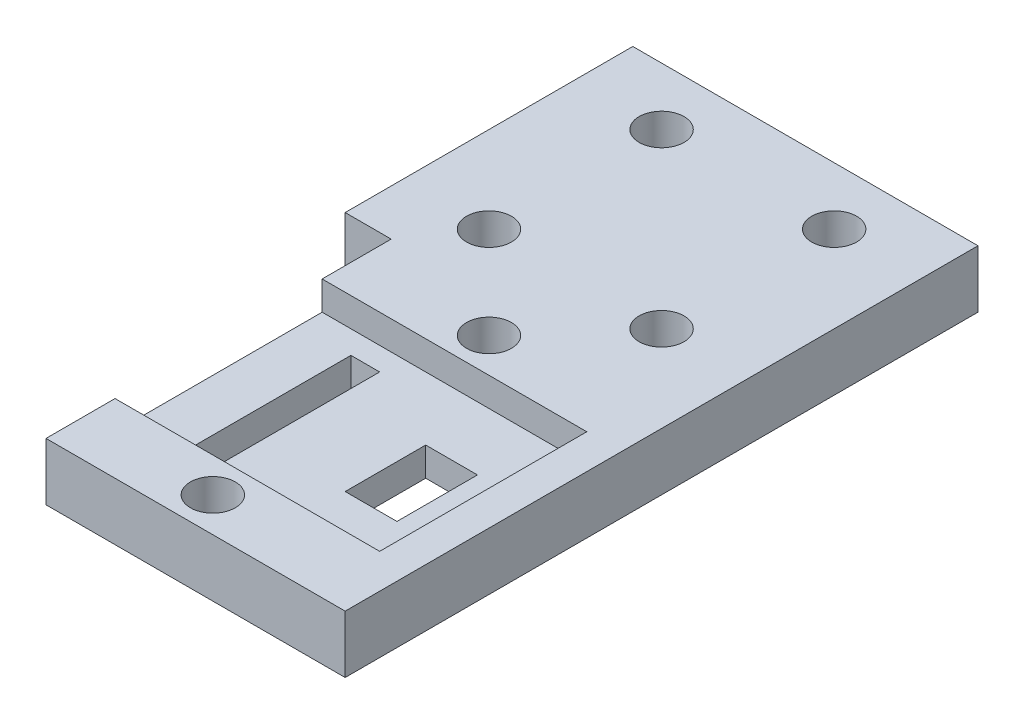
ISO-10303-21;
HEADER;
FILE_DESCRIPTION(('STEP AP214'),'2;1');
FILE_NAME('part.step','',(''),(''),'','','');
FILE_SCHEMA(('AUTOMOTIVE_DESIGN { 1 0 10303 214 1 1 1 1 }'));
ENDSEC;
DATA;
#1=APPLICATION_CONTEXT('core data for automotive mechanical design processes');
#2=APPLICATION_PROTOCOL_DEFINITION('international standard','automotive_design',2000,#1);
#3=PRODUCT_CONTEXT('',#1,'mechanical');
#4=PRODUCT('Part','Part','',(#3));
#5=PRODUCT_RELATED_PRODUCT_CATEGORY('part','',(#4));
#6=PRODUCT_DEFINITION_FORMATION('','',#4);
#7=PRODUCT_DEFINITION_CONTEXT('part definition',#1,'design');
#8=PRODUCT_DEFINITION('design','',#6,#7);
#9=PRODUCT_DEFINITION_SHAPE('','',#8);
#10=(LENGTH_UNIT() NAMED_UNIT(*) SI_UNIT(.MILLI.,.METRE.));
#11=(NAMED_UNIT(*) PLANE_ANGLE_UNIT() SI_UNIT($,.RADIAN.));
#12=(NAMED_UNIT(*) SI_UNIT($,.STERADIAN.) SOLID_ANGLE_UNIT());
#13=UNCERTAINTY_MEASURE_WITH_UNIT(LENGTH_MEASURE(1.E-05),#10,'distance_accuracy_value','');
#14=(GEOMETRIC_REPRESENTATION_CONTEXT(3) GLOBAL_UNCERTAINTY_ASSIGNED_CONTEXT((#13)) GLOBAL_UNIT_ASSIGNED_CONTEXT((#10,
#11,#12)) REPRESENTATION_CONTEXT('',''));
#15=CARTESIAN_POINT('',(0.,0.,0.));
#16=DIRECTION('',(0.,0.,1.));
#17=DIRECTION('',(1.,0.,0.));
#18=AXIS2_PLACEMENT_3D('',#15,#16,#17);
#19=CARTESIAN_POINT('',(0.,5.,0.));
#20=DIRECTION('',(0.,-1.,0.));
#21=DIRECTION('',(0.,0.,-1.));
#22=AXIS2_PLACEMENT_3D('',#19,#20,#21);
#23=PLANE('',#22);
#24=DIRECTION('',(0.,0.,-1.));
#25=VECTOR('',#24,1.);
#26=CARTESIAN_POINT('',(27.,5.,-11.));
#27=LINE('',#26,#25);
#28=CARTESIAN_POINT('',(27.,5.,-11.));
#29=VERTEX_POINT('',#28);
#30=CARTESIAN_POINT('',(27.,5.,-29.));
#31=VERTEX_POINT('',#30);
#32=EDGE_CURVE('E221',#29,#31,#27,.T.);
#33=ORIENTED_EDGE('',*,*,#32,.F.);
#34=DIRECTION('',(1.,0.,0.));
#35=VECTOR('',#34,1.);
#36=CARTESIAN_POINT('',(27.,5.,-11.));
#37=LINE('',#36,#35);
#38=CARTESIAN_POINT('',(4.,5.,-11.));
#39=VERTEX_POINT('',#38);
#40=EDGE_CURVE('E232',#39,#29,#37,.T.);
#41=ORIENTED_EDGE('',*,*,#40,.F.);
#42=DIRECTION('',(0.,0.,1.));
#43=VECTOR('',#42,1.);
#44=CARTESIAN_POINT('',(4.,5.,0.));
#45=LINE('',#44,#43);
#46=CARTESIAN_POINT('',(4.,5.,-5.));
#47=VERTEX_POINT('',#46);
#48=EDGE_CURVE('E266',#39,#47,#45,.T.);
#49=ORIENTED_EDGE('',*,*,#48,.T.);
#50=DIRECTION('',(-1.,0.,0.));
#51=VECTOR('',#50,1.);
#52=CARTESIAN_POINT('',(0.,5.,-5.));
#53=LINE('',#52,#51);
#54=CARTESIAN_POINT('',(30.,5.,-5.));
#55=VERTEX_POINT('',#54);
#56=EDGE_CURVE('E270',#55,#47,#53,.T.);
#57=ORIENTED_EDGE('',*,*,#56,.F.);
#58=DIRECTION('',(0.,0.,-1.));
#59=VECTOR('',#58,1.);
#60=CARTESIAN_POINT('',(30.,5.,0.));
#61=LINE('',#60,#59);
#62=CARTESIAN_POINT('',(30.,5.,-60.));
#63=VERTEX_POINT('',#62);
#64=EDGE_CURVE('E321',#55,#63,#61,.T.);
#65=ORIENTED_EDGE('',*,*,#64,.T.);
#66=DIRECTION('',(-1.,0.,0.));
#67=VECTOR('',#66,1.);
#68=CARTESIAN_POINT('',(0.,5.,-60.));
#69=LINE('',#68,#67);
#70=CARTESIAN_POINT('',(0.,5.,-60.));
#71=VERTEX_POINT('',#70);
#72=EDGE_CURVE('E324',#63,#71,#69,.T.);
#73=ORIENTED_EDGE('',*,*,#72,.T.);
#74=DIRECTION('',(0.,0.,1.));
#75=VECTOR('',#74,1.);
#76=CARTESIAN_POINT('',(0.,5.,0.));
#77=LINE('',#76,#75);
#78=CARTESIAN_POINT('',(0.,5.,-35.));
#79=VERTEX_POINT('',#78);
#80=EDGE_CURVE('E318',#71,#79,#77,.T.);
#81=ORIENTED_EDGE('',*,*,#80,.T.);
#82=DIRECTION('',(-1.,0.,0.));
#83=VECTOR('',#82,1.);
#84=CARTESIAN_POINT('',(0.,5.,-35.));
#85=LINE('',#84,#83);
#86=CARTESIAN_POINT('',(4.,5.,-35.));
#87=VERTEX_POINT('',#86);
#88=EDGE_CURVE('E280',#87,#79,#85,.T.);
#89=ORIENTED_EDGE('',*,*,#88,.F.);
#90=CARTESIAN_POINT('',(4.,5.,-29.));
#91=VERTEX_POINT('',#90);
#92=EDGE_CURVE('E277',#87,#91,#45,.T.);
#93=ORIENTED_EDGE('',*,*,#92,.T.);
#94=DIRECTION('',(-1.,0.,0.));
#95=VECTOR('',#94,1.);
#96=CARTESIAN_POINT('',(27.,5.,-29.));
#97=LINE('',#96,#95);
#98=EDGE_CURVE('E242',#31,#91,#97,.T.);
#99=ORIENTED_EDGE('',*,*,#98,.F.);
#100=EDGE_LOOP('',(#33,#41,#49,#57,#65,#73,#81,#89,#93,#99));
#101=FACE_BOUND('',#100,.T.);
#102=CARTESIAN_POINT('',(7.5,5.,-55.));
#103=DIRECTION('',(0.,1.,0.));
#104=DIRECTION('',(0.,0.,1.));
#105=AXIS2_PLACEMENT_3D('',#102,#103,#104);
#106=CIRCLE('',#105,1.94999999999999);
#107=CARTESIAN_POINT('',(7.5,5.,-53.05));
#108=VERTEX_POINT('',#107);
#109=EDGE_CURVE('E311',#108,#108,#106,.T.);
#110=ORIENTED_EDGE('',*,*,#109,.F.);
#111=EDGE_LOOP('',(#110));
#112=FACE_BOUND('',#111,.T.);
#113=CARTESIAN_POINT('',(22.5,5.,-55.));
#114=DIRECTION('',(0.,1.,0.));
#115=DIRECTION('',(0.,0.,1.));
#116=AXIS2_PLACEMENT_3D('',#113,#114,#115);
#117=CIRCLE('',#116,1.94999999999999);
#118=CARTESIAN_POINT('',(22.5,5.,-53.05));
#119=VERTEX_POINT('',#118);
#120=EDGE_CURVE('E305',#119,#119,#117,.T.);
#121=ORIENTED_EDGE('',*,*,#120,.F.);
#122=EDGE_LOOP('',(#121));
#123=FACE_BOUND('',#122,.T.);
#124=CARTESIAN_POINT('',(22.5,5.,-40.));
#125=DIRECTION('',(0.,1.,0.));
#126=DIRECTION('',(0.,0.,1.));
#127=AXIS2_PLACEMENT_3D('',#124,#125,#126);
#128=CIRCLE('',#127,1.94999999999999);
#129=CARTESIAN_POINT('',(22.5,5.,-38.05));
#130=VERTEX_POINT('',#129);
#131=EDGE_CURVE('E299',#130,#130,#128,.T.);
#132=ORIENTED_EDGE('',*,*,#131,.F.);
#133=EDGE_LOOP('',(#132));
#134=FACE_BOUND('',#133,.T.);
#135=CARTESIAN_POINT('',(7.5,5.,-40.));
#136=DIRECTION('',(0.,1.,0.));
#137=DIRECTION('',(0.,0.,1.));
#138=AXIS2_PLACEMENT_3D('',#135,#136,#137);
#139=CIRCLE('',#138,1.94999999999999);
#140=CARTESIAN_POINT('',(7.5,5.,-38.05));
#141=VERTEX_POINT('',#140);
#142=EDGE_CURVE('E287',#141,#141,#139,.T.);
#143=ORIENTED_EDGE('',*,*,#142,.F.);
#144=EDGE_LOOP('',(#143));
#145=FACE_BOUND('',#144,.T.);
#146=CARTESIAN_POINT('',(15.5,5.,-8.));
#147=DIRECTION('',(0.,1.,0.));
#148=DIRECTION('',(0.,0.,1.));
#149=AXIS2_PLACEMENT_3D('',#146,#147,#148);
#150=CIRCLE('',#149,1.94999999999999);
#151=CARTESIAN_POINT('',(15.5,5.,-6.05000000000001));
#152=VERTEX_POINT('',#151);
#153=EDGE_CURVE('E260',#152,#152,#150,.T.);
#154=ORIENTED_EDGE('',*,*,#153,.F.);
#155=EDGE_LOOP('',(#154));
#156=FACE_BOUND('',#155,.T.);
#157=CARTESIAN_POINT('',(15.5,5.,-32.));
#158=DIRECTION('',(0.,1.,0.));
#159=DIRECTION('',(0.,0.,1.));
#160=AXIS2_PLACEMENT_3D('',#157,#158,#159);
#161=CIRCLE('',#160,1.94999999999999);
#162=CARTESIAN_POINT('',(15.5,5.,-30.05));
#163=VERTEX_POINT('',#162);
#164=EDGE_CURVE('E248',#163,#163,#161,.T.);
#165=ORIENTED_EDGE('',*,*,#164,.F.);
#166=EDGE_LOOP('',(#165));
#167=FACE_BOUND('',#166,.T.);
#168=ADVANCED_FACE('F34',(#101,#112,#123,#134,#145,#156,#167),#23,.F.);
#169=CARTESIAN_POINT('',(0.,5.,0.));
#170=DIRECTION('',(1.,0.,0.));
#171=DIRECTION('',(0.,0.,-1.));
#172=AXIS2_PLACEMENT_3D('',#169,#170,#171);
#173=PLANE('',#172);
#174=DIRECTION('',(0.,0.,1.));
#175=VECTOR('',#174,1.);
#176=CARTESIAN_POINT('',(0.,0.,0.));
#177=LINE('',#176,#175);
#178=CARTESIAN_POINT('',(0.,0.,-60.));
#179=VERTEX_POINT('',#178);
#180=CARTESIAN_POINT('',(0.,0.,-35.));
#181=VERTEX_POINT('',#180);
#182=EDGE_CURVE('E317',#179,#181,#177,.T.);
#183=ORIENTED_EDGE('',*,*,#182,.T.);
#184=DIRECTION('',(0.,1.,0.));
#185=VECTOR('',#184,1.);
#186=CARTESIAN_POINT('',(0.,0.,-35.));
#187=LINE('',#186,#185);
#188=EDGE_CURVE('E290',#181,#79,#187,.T.);
#189=ORIENTED_EDGE('',*,*,#188,.T.);
#190=ORIENTED_EDGE('',*,*,#80,.F.);
#191=DIRECTION('',(0.,-1.,0.));
#192=VECTOR('',#191,1.);
#193=CARTESIAN_POINT('',(0.,5.,-60.));
#194=LINE('',#193,#192);
#195=EDGE_CURVE('E42',#71,#179,#194,.T.);
#196=ORIENTED_EDGE('',*,*,#195,.T.);
#197=EDGE_LOOP('',(#183,#189,#190,#196));
#198=FACE_BOUND('',#197,.T.);
#199=ADVANCED_FACE('F36',(#198),#173,.F.);
#200=CARTESIAN_POINT('',(30.,5.,0.));
#201=DIRECTION('',(-1.,0.,0.));
#202=DIRECTION('',(0.,0.,1.));
#203=AXIS2_PLACEMENT_3D('',#200,#201,#202);
#204=PLANE('',#203);
#205=ORIENTED_EDGE('',*,*,#64,.F.);
#206=DIRECTION('',(0.,1.,0.));
#207=VECTOR('',#206,1.);
#208=CARTESIAN_POINT('',(30.,0.,-5.));
#209=LINE('',#208,#207);
#210=CARTESIAN_POINT('',(30.,0.,-5.));
#211=VERTEX_POINT('',#210);
#212=EDGE_CURVE('E288',#211,#55,#209,.T.);
#213=ORIENTED_EDGE('',*,*,#212,.F.);
#214=DIRECTION('',(0.,0.,-1.));
#215=VECTOR('',#214,1.);
#216=CARTESIAN_POINT('',(30.,0.,0.));
#217=LINE('',#216,#215);
#218=CARTESIAN_POINT('',(30.,0.,-60.));
#219=VERTEX_POINT('',#218);
#220=EDGE_CURVE('E328',#211,#219,#217,.T.);
#221=ORIENTED_EDGE('',*,*,#220,.T.);
#222=DIRECTION('',(0.,-1.,0.));
#223=VECTOR('',#222,1.);
#224=CARTESIAN_POINT('',(30.,5.,-60.));
#225=LINE('',#224,#223);
#226=EDGE_CURVE('E11',#63,#219,#225,.T.);
#227=ORIENTED_EDGE('',*,*,#226,.F.);
#228=EDGE_LOOP('',(#205,#213,#221,#227));
#229=FACE_BOUND('',#228,.T.);
#230=ADVANCED_FACE('F355',(#229),#204,.F.);
#231=CARTESIAN_POINT('',(0.,5.,-60.));
#232=DIRECTION('',(0.,0.,1.));
#233=DIRECTION('',(1.,0.,0.));
#234=AXIS2_PLACEMENT_3D('',#231,#232,#233);
#235=PLANE('',#234);
#236=DIRECTION('',(-1.,0.,0.));
#237=VECTOR('',#236,1.);
#238=CARTESIAN_POINT('',(0.,0.,-60.));
#239=LINE('',#238,#237);
#240=EDGE_CURVE('E322',#219,#179,#239,.T.);
#241=ORIENTED_EDGE('',*,*,#240,.T.);
#242=ORIENTED_EDGE('',*,*,#195,.F.);
#243=ORIENTED_EDGE('',*,*,#72,.F.);
#244=ORIENTED_EDGE('',*,*,#226,.T.);
#245=EDGE_LOOP('',(#241,#242,#243,#244));
#246=FACE_BOUND('',#245,.T.);
#247=ADVANCED_FACE('F353',(#246),#235,.F.);
#248=CARTESIAN_POINT('',(0.,0.,0.));
#249=DIRECTION('',(0.,-1.,0.));
#250=DIRECTION('',(0.,0.,-1.));
#251=AXIS2_PLACEMENT_3D('',#248,#249,#250);
#252=PLANE('',#251);
#253=DIRECTION('',(0.,0.,1.));
#254=VECTOR('',#253,1.);
#255=CARTESIAN_POINT('',(18.5,0.,-23.5));
#256=LINE('',#255,#254);
#257=CARTESIAN_POINT('',(18.5,0.,-23.5));
#258=VERTEX_POINT('',#257);
#259=CARTESIAN_POINT('',(18.5,0.,-16.5));
#260=VERTEX_POINT('',#259);
#261=EDGE_CURVE('E161',#258,#260,#256,.T.);
#262=ORIENTED_EDGE('',*,*,#261,.T.);
#263=DIRECTION('',(1.,0.,0.));
#264=VECTOR('',#263,1.);
#265=CARTESIAN_POINT('',(18.5,0.,-16.5));
#266=LINE('',#265,#264);
#267=CARTESIAN_POINT('',(23.,0.,-16.5));
#268=VERTEX_POINT('',#267);
#269=EDGE_CURVE('E170',#260,#268,#266,.T.);
#270=ORIENTED_EDGE('',*,*,#269,.T.);
#271=DIRECTION('',(0.,0.,-1.));
#272=VECTOR('',#271,1.);
#273=CARTESIAN_POINT('',(23.,0.,-23.5));
#274=LINE('',#273,#272);
#275=CARTESIAN_POINT('',(23.,0.,-23.5));
#276=VERTEX_POINT('',#275);
#277=EDGE_CURVE('E49',#268,#276,#274,.T.);
#278=ORIENTED_EDGE('',*,*,#277,.T.);
#279=DIRECTION('',(-1.,0.,0.));
#280=VECTOR('',#279,1.);
#281=CARTESIAN_POINT('',(18.5,0.,-23.5));
#282=LINE('',#281,#280);
#283=EDGE_CURVE('E167',#276,#258,#282,.T.);
#284=ORIENTED_EDGE('',*,*,#283,.T.);
#285=EDGE_LOOP('',(#262,#270,#278,#284));
#286=FACE_BOUND('',#285,.T.);
#287=DIRECTION('',(0.,0.,1.));
#288=VECTOR('',#287,1.);
#289=CARTESIAN_POINT('',(8.5,0.,-27.));
#290=LINE('',#289,#288);
#291=CARTESIAN_POINT('',(8.5,0.,-27.));
#292=VERTEX_POINT('',#291);
#293=CARTESIAN_POINT('',(8.5,0.,-13.));
#294=VERTEX_POINT('',#293);
#295=EDGE_CURVE('E196',#292,#294,#290,.T.);
#296=ORIENTED_EDGE('',*,*,#295,.T.);
#297=DIRECTION('',(1.,0.,0.));
#298=VECTOR('',#297,1.);
#299=CARTESIAN_POINT('',(8.5,0.,-13.));
#300=LINE('',#299,#298);
#301=CARTESIAN_POINT('',(11.,0.,-13.));
#302=VERTEX_POINT('',#301);
#303=EDGE_CURVE('E199',#294,#302,#300,.T.);
#304=ORIENTED_EDGE('',*,*,#303,.T.);
#305=DIRECTION('',(0.,0.,-1.));
#306=VECTOR('',#305,1.);
#307=CARTESIAN_POINT('',(11.,0.,-27.));
#308=LINE('',#307,#306);
#309=CARTESIAN_POINT('',(11.,0.,-27.));
#310=VERTEX_POINT('',#309);
#311=EDGE_CURVE('E203',#302,#310,#308,.T.);
#312=ORIENTED_EDGE('',*,*,#311,.T.);
#313=DIRECTION('',(-1.,0.,0.));
#314=VECTOR('',#313,1.);
#315=CARTESIAN_POINT('',(8.5,0.,-27.));
#316=LINE('',#315,#314);
#317=EDGE_CURVE('E206',#310,#292,#316,.T.);
#318=ORIENTED_EDGE('',*,*,#317,.T.);
#319=EDGE_LOOP('',(#296,#304,#312,#318));
#320=FACE_BOUND('',#319,.T.);
#321=CARTESIAN_POINT('',(15.5,0.,-32.));
#322=DIRECTION('',(0.,1.,0.));
#323=DIRECTION('',(0.,0.,1.));
#324=AXIS2_PLACEMENT_3D('',#321,#322,#323);
#325=CIRCLE('',#324,1.94999999999999);
#326=CARTESIAN_POINT('',(15.5,0.,-30.05));
#327=VERTEX_POINT('',#326);
#328=EDGE_CURVE('E257',#327,#327,#325,.T.);
#329=ORIENTED_EDGE('',*,*,#328,.T.);
#330=EDGE_LOOP('',(#329));
#331=FACE_BOUND('',#330,.T.);
#332=CARTESIAN_POINT('',(15.5,0.,-8.));
#333=DIRECTION('',(0.,1.,0.));
#334=DIRECTION('',(0.,0.,1.));
#335=AXIS2_PLACEMENT_3D('',#332,#333,#334);
#336=CIRCLE('',#335,1.94999999999999);
#337=CARTESIAN_POINT('',(15.5,0.,-6.05000000000001));
#338=VERTEX_POINT('',#337);
#339=EDGE_CURVE('E263',#338,#338,#336,.T.);
#340=ORIENTED_EDGE('',*,*,#339,.T.);
#341=EDGE_LOOP('',(#340));
#342=FACE_BOUND('',#341,.T.);
#343=DIRECTION('',(-1.,0.,0.));
#344=VECTOR('',#343,1.);
#345=CARTESIAN_POINT('',(0.,0.,-5.));
#346=LINE('',#345,#344);
#347=CARTESIAN_POINT('',(4.,0.,-5.));
#348=VERTEX_POINT('',#347);
#349=EDGE_CURVE('E273',#211,#348,#346,.T.);
#350=ORIENTED_EDGE('',*,*,#349,.T.);
#351=DIRECTION('',(0.,0.,1.));
#352=VECTOR('',#351,1.);
#353=CARTESIAN_POINT('',(4.,0.,0.));
#354=LINE('',#353,#352);
#355=CARTESIAN_POINT('',(4.,0.,-35.));
#356=VERTEX_POINT('',#355);
#357=EDGE_CURVE('E267',#356,#348,#354,.T.);
#358=ORIENTED_EDGE('',*,*,#357,.F.);
#359=DIRECTION('',(-1.,0.,0.));
#360=VECTOR('',#359,1.);
#361=CARTESIAN_POINT('',(0.,0.,-35.));
#362=LINE('',#361,#360);
#363=EDGE_CURVE('E269',#356,#181,#362,.T.);
#364=ORIENTED_EDGE('',*,*,#363,.T.);
#365=ORIENTED_EDGE('',*,*,#182,.F.);
#366=ORIENTED_EDGE('',*,*,#240,.F.);
#367=ORIENTED_EDGE('',*,*,#220,.F.);
#368=EDGE_LOOP('',(#350,#358,#364,#365,#366,#367));
#369=FACE_BOUND('',#368,.T.);
#370=CARTESIAN_POINT('',(7.5,0.,-40.));
#371=DIRECTION('',(0.,1.,0.));
#372=DIRECTION('',(0.,0.,1.));
#373=AXIS2_PLACEMENT_3D('',#370,#371,#372);
#374=CIRCLE('',#373,1.95);
#375=CARTESIAN_POINT('',(7.5,0.,-38.05));
#376=VERTEX_POINT('',#375);
#377=EDGE_CURVE('E296',#376,#376,#374,.T.);
#378=ORIENTED_EDGE('',*,*,#377,.T.);
#379=EDGE_LOOP('',(#378));
#380=FACE_BOUND('',#379,.T.);
#381=CARTESIAN_POINT('',(22.5,0.,-40.));
#382=DIRECTION('',(0.,1.,0.));
#383=DIRECTION('',(0.,0.,1.));
#384=AXIS2_PLACEMENT_3D('',#381,#382,#383);
#385=CIRCLE('',#384,1.95);
#386=CARTESIAN_POINT('',(22.5,0.,-38.05));
#387=VERTEX_POINT('',#386);
#388=EDGE_CURVE('E302',#387,#387,#385,.T.);
#389=ORIENTED_EDGE('',*,*,#388,.T.);
#390=EDGE_LOOP('',(#389));
#391=FACE_BOUND('',#390,.T.);
#392=CARTESIAN_POINT('',(22.5,0.,-55.));
#393=DIRECTION('',(0.,1.,0.));
#394=DIRECTION('',(0.,0.,1.));
#395=AXIS2_PLACEMENT_3D('',#392,#393,#394);
#396=CIRCLE('',#395,1.95);
#397=CARTESIAN_POINT('',(22.5,0.,-53.05));
#398=VERTEX_POINT('',#397);
#399=EDGE_CURVE('E308',#398,#398,#396,.T.);
#400=ORIENTED_EDGE('',*,*,#399,.T.);
#401=EDGE_LOOP('',(#400));
#402=FACE_BOUND('',#401,.T.);
#403=CARTESIAN_POINT('',(7.5,0.,-55.));
#404=DIRECTION('',(0.,1.,0.));
#405=DIRECTION('',(0.,0.,1.));
#406=AXIS2_PLACEMENT_3D('',#403,#404,#405);
#407=CIRCLE('',#406,1.95);
#408=CARTESIAN_POINT('',(7.5,0.,-53.05));
#409=VERTEX_POINT('',#408);
#410=EDGE_CURVE('E314',#409,#409,#407,.T.);
#411=ORIENTED_EDGE('',*,*,#410,.T.);
#412=EDGE_LOOP('',(#411));
#413=FACE_BOUND('',#412,.T.);
#414=ADVANCED_FACE('F174',(#286,#320,#331,#342,#369,#380,#391,#402,#413),#252,.T.);
#415=CARTESIAN_POINT('',(7.5,5.,-55.));
#416=DIRECTION('',(0.,1.,0.));
#417=DIRECTION('',(0.,0.,1.));
#418=AXIS2_PLACEMENT_3D('',#415,#416,#417);
#419=CYLINDRICAL_SURFACE('',#418,1.94999999999999);
#420=ORIENTED_EDGE('',*,*,#410,.F.);
#421=EDGE_LOOP('',(#420));
#422=FACE_BOUND('',#421,.T.);
#423=ORIENTED_EDGE('',*,*,#109,.T.);
#424=EDGE_LOOP('',(#423));
#425=FACE_BOUND('',#424,.T.);
#426=ADVANCED_FACE('F400',(#422,#425),#419,.F.);
#427=CARTESIAN_POINT('',(22.5,5.,-55.));
#428=DIRECTION('',(0.,1.,0.));
#429=DIRECTION('',(0.,0.,1.));
#430=AXIS2_PLACEMENT_3D('',#427,#428,#429);
#431=CYLINDRICAL_SURFACE('',#430,1.94999999999999);
#432=ORIENTED_EDGE('',*,*,#399,.F.);
#433=EDGE_LOOP('',(#432));
#434=FACE_BOUND('',#433,.T.);
#435=ORIENTED_EDGE('',*,*,#120,.T.);
#436=EDGE_LOOP('',(#435));
#437=FACE_BOUND('',#436,.T.);
#438=ADVANCED_FACE('F426',(#434,#437),#431,.F.);
#439=CARTESIAN_POINT('',(22.5,5.,-40.));
#440=DIRECTION('',(0.,1.,0.));
#441=DIRECTION('',(0.,0.,1.));
#442=AXIS2_PLACEMENT_3D('',#439,#440,#441);
#443=CYLINDRICAL_SURFACE('',#442,1.94999999999999);
#444=ORIENTED_EDGE('',*,*,#388,.F.);
#445=EDGE_LOOP('',(#444));
#446=FACE_BOUND('',#445,.T.);
#447=ORIENTED_EDGE('',*,*,#131,.T.);
#448=EDGE_LOOP('',(#447));
#449=FACE_BOUND('',#448,.T.);
#450=ADVANCED_FACE('F433',(#446,#449),#443,.F.);
#451=CARTESIAN_POINT('',(7.5,5.,-40.));
#452=DIRECTION('',(0.,1.,0.));
#453=DIRECTION('',(0.,0.,1.));
#454=AXIS2_PLACEMENT_3D('',#451,#452,#453);
#455=CYLINDRICAL_SURFACE('',#454,1.94999999999999);
#456=ORIENTED_EDGE('',*,*,#377,.F.);
#457=EDGE_LOOP('',(#456));
#458=FACE_BOUND('',#457,.T.);
#459=ORIENTED_EDGE('',*,*,#142,.T.);
#460=EDGE_LOOP('',(#459));
#461=FACE_BOUND('',#460,.T.);
#462=ADVANCED_FACE('F440',(#458,#461),#455,.F.);
#463=CARTESIAN_POINT('',(4.,0.,0.));
#464=DIRECTION('',(-1.,0.,0.));
#465=DIRECTION('',(0.,0.,1.));
#466=AXIS2_PLACEMENT_3D('',#463,#464,#465);
#467=PLANE('',#466);
#468=DIRECTION('',(0.,1.,0.));
#469=VECTOR('',#468,1.);
#470=CARTESIAN_POINT('',(4.,2.5,-11.));
#471=LINE('',#470,#469);
#472=CARTESIAN_POINT('',(4.,2.5,-11.));
#473=VERTEX_POINT('',#472);
#474=EDGE_CURVE('E249',#473,#39,#471,.T.);
#475=ORIENTED_EDGE('',*,*,#474,.F.);
#476=DIRECTION('',(0.,0.,1.));
#477=VECTOR('',#476,1.);
#478=CARTESIAN_POINT('',(4.,2.5,-11.));
#479=LINE('',#478,#477);
#480=CARTESIAN_POINT('',(4.,2.5,-29.));
#481=VERTEX_POINT('',#480);
#482=EDGE_CURVE('E234',#481,#473,#479,.T.);
#483=ORIENTED_EDGE('',*,*,#482,.F.);
#484=DIRECTION('',(0.,1.,0.));
#485=VECTOR('',#484,1.);
#486=CARTESIAN_POINT('',(4.,2.5,-29.));
#487=LINE('',#486,#485);
#488=EDGE_CURVE('E251',#481,#91,#487,.T.);
#489=ORIENTED_EDGE('',*,*,#488,.T.);
#490=ORIENTED_EDGE('',*,*,#92,.F.);
#491=DIRECTION('',(0.,1.,0.));
#492=VECTOR('',#491,1.);
#493=CARTESIAN_POINT('',(4.,0.,-35.));
#494=LINE('',#493,#492);
#495=EDGE_CURVE('E276',#356,#87,#494,.T.);
#496=ORIENTED_EDGE('',*,*,#495,.F.);
#497=ORIENTED_EDGE('',*,*,#357,.T.);
#498=DIRECTION('',(0.,1.,0.));
#499=VECTOR('',#498,1.);
#500=CARTESIAN_POINT('',(4.,0.,-5.));
#501=LINE('',#500,#499);
#502=EDGE_CURVE('E284',#348,#47,#501,.T.);
#503=ORIENTED_EDGE('',*,*,#502,.T.);
#504=ORIENTED_EDGE('',*,*,#48,.F.);
#505=EDGE_LOOP('',(#475,#483,#489,#490,#496,#497,#503,#504));
#506=FACE_BOUND('',#505,.T.);
#507=ADVANCED_FACE('F363',(#506),#467,.T.);
#508=CARTESIAN_POINT('',(0.,0.,-5.));
#509=DIRECTION('',(0.,0.,-1.));
#510=DIRECTION('',(-1.,0.,0.));
#511=AXIS2_PLACEMENT_3D('',#508,#509,#510);
#512=PLANE('',#511);
#513=ORIENTED_EDGE('',*,*,#56,.T.);
#514=ORIENTED_EDGE('',*,*,#502,.F.);
#515=ORIENTED_EDGE('',*,*,#349,.F.);
#516=ORIENTED_EDGE('',*,*,#212,.T.);
#517=EDGE_LOOP('',(#513,#514,#515,#516));
#518=FACE_BOUND('',#517,.T.);
#519=ADVANCED_FACE('F359',(#518),#512,.F.);
#520=CARTESIAN_POINT('',(0.,0.,-35.));
#521=DIRECTION('',(0.,0.,-1.));
#522=DIRECTION('',(-1.,0.,0.));
#523=AXIS2_PLACEMENT_3D('',#520,#521,#522);
#524=PLANE('',#523);
#525=ORIENTED_EDGE('',*,*,#88,.T.);
#526=ORIENTED_EDGE('',*,*,#188,.F.);
#527=ORIENTED_EDGE('',*,*,#363,.F.);
#528=ORIENTED_EDGE('',*,*,#495,.T.);
#529=EDGE_LOOP('',(#525,#526,#527,#528));
#530=FACE_BOUND('',#529,.T.);
#531=ADVANCED_FACE('F344',(#530),#524,.F.);
#532=CARTESIAN_POINT('',(15.5,5.,-8.));
#533=DIRECTION('',(0.,1.,0.));
#534=DIRECTION('',(0.,0.,1.));
#535=AXIS2_PLACEMENT_3D('',#532,#533,#534);
#536=CYLINDRICAL_SURFACE('',#535,1.94999999999999);
#537=ORIENTED_EDGE('',*,*,#339,.F.);
#538=EDGE_LOOP('',(#537));
#539=FACE_BOUND('',#538,.T.);
#540=ORIENTED_EDGE('',*,*,#153,.T.);
#541=EDGE_LOOP('',(#540));
#542=FACE_BOUND('',#541,.T.);
#543=ADVANCED_FACE('F467',(#539,#542),#536,.F.);
#544=CARTESIAN_POINT('',(15.5,5.,-32.));
#545=DIRECTION('',(0.,1.,0.));
#546=DIRECTION('',(0.,0.,1.));
#547=AXIS2_PLACEMENT_3D('',#544,#545,#546);
#548=CYLINDRICAL_SURFACE('',#547,1.94999999999999);
#549=ORIENTED_EDGE('',*,*,#328,.F.);
#550=EDGE_LOOP('',(#549));
#551=FACE_BOUND('',#550,.T.);
#552=ORIENTED_EDGE('',*,*,#164,.T.);
#553=EDGE_LOOP('',(#552));
#554=FACE_BOUND('',#553,.T.);
#555=ADVANCED_FACE('F474',(#551,#554),#548,.F.);
#556=CARTESIAN_POINT('',(27.,2.5,-11.));
#557=DIRECTION('',(1.,0.,0.));
#558=DIRECTION('',(0.,0.,-1.));
#559=AXIS2_PLACEMENT_3D('',#556,#557,#558);
#560=PLANE('',#559);
#561=ORIENTED_EDGE('',*,*,#32,.T.);
#562=DIRECTION('',(0.,1.,0.));
#563=VECTOR('',#562,1.);
#564=CARTESIAN_POINT('',(27.,2.5,-29.));
#565=LINE('',#564,#563);
#566=CARTESIAN_POINT('',(27.,2.5,-29.));
#567=VERTEX_POINT('',#566);
#568=EDGE_CURVE('E239',#567,#31,#565,.T.);
#569=ORIENTED_EDGE('',*,*,#568,.F.);
#570=DIRECTION('',(0.,0.,-1.));
#571=VECTOR('',#570,1.);
#572=CARTESIAN_POINT('',(27.,2.5,-11.));
#573=LINE('',#572,#571);
#574=CARTESIAN_POINT('',(27.,2.5,-11.));
#575=VERTEX_POINT('',#574);
#576=EDGE_CURVE('E228',#575,#567,#573,.T.);
#577=ORIENTED_EDGE('',*,*,#576,.F.);
#578=DIRECTION('',(0.,1.,0.));
#579=VECTOR('',#578,1.);
#580=CARTESIAN_POINT('',(27.,2.5,-11.));
#581=LINE('',#580,#579);
#582=EDGE_CURVE('E246',#575,#29,#581,.T.);
#583=ORIENTED_EDGE('',*,*,#582,.T.);
#584=EDGE_LOOP('',(#561,#569,#577,#583));
#585=FACE_BOUND('',#584,.T.);
#586=ADVANCED_FACE('F373',(#585),#560,.F.);
#587=CARTESIAN_POINT('',(27.,2.5,-11.));
#588=DIRECTION('',(0.,0.,1.));
#589=DIRECTION('',(1.,0.,0.));
#590=AXIS2_PLACEMENT_3D('',#587,#588,#589);
#591=PLANE('',#590);
#592=ORIENTED_EDGE('',*,*,#40,.T.);
#593=ORIENTED_EDGE('',*,*,#582,.F.);
#594=DIRECTION('',(1.,0.,0.));
#595=VECTOR('',#594,1.);
#596=CARTESIAN_POINT('',(27.,2.5,-11.));
#597=LINE('',#596,#595);
#598=EDGE_CURVE('E236',#473,#575,#597,.T.);
#599=ORIENTED_EDGE('',*,*,#598,.F.);
#600=ORIENTED_EDGE('',*,*,#474,.T.);
#601=EDGE_LOOP('',(#592,#593,#599,#600));
#602=FACE_BOUND('',#601,.T.);
#603=ADVANCED_FACE('F376',(#602),#591,.F.);
#604=CARTESIAN_POINT('',(27.,2.5,-29.));
#605=DIRECTION('',(0.,0.,-1.));
#606=DIRECTION('',(-1.,0.,0.));
#607=AXIS2_PLACEMENT_3D('',#604,#605,#606);
#608=PLANE('',#607);
#609=ORIENTED_EDGE('',*,*,#98,.T.);
#610=ORIENTED_EDGE('',*,*,#488,.F.);
#611=DIRECTION('',(-1.,0.,0.));
#612=VECTOR('',#611,1.);
#613=CARTESIAN_POINT('',(27.,2.5,-29.));
#614=LINE('',#613,#612);
#615=EDGE_CURVE('E231',#567,#481,#614,.T.);
#616=ORIENTED_EDGE('',*,*,#615,.F.);
#617=ORIENTED_EDGE('',*,*,#568,.T.);
#618=EDGE_LOOP('',(#609,#610,#616,#617));
#619=FACE_BOUND('',#618,.T.);
#620=ADVANCED_FACE('F369',(#619),#608,.F.);
#621=CARTESIAN_POINT('',(0.,2.5,0.));
#622=DIRECTION('',(0.,1.,0.));
#623=DIRECTION('',(0.,0.,1.));
#624=AXIS2_PLACEMENT_3D('',#621,#622,#623);
#625=PLANE('',#624);
#626=DIRECTION('',(0.,0.,1.));
#627=VECTOR('',#626,1.);
#628=CARTESIAN_POINT('',(18.5,2.5,-23.5));
#629=LINE('',#628,#627);
#630=CARTESIAN_POINT('',(18.5,2.5,-23.5));
#631=VERTEX_POINT('',#630);
#632=CARTESIAN_POINT('',(18.5,2.5,-16.5));
#633=VERTEX_POINT('',#632);
#634=EDGE_CURVE('E57',#631,#633,#629,.T.);
#635=ORIENTED_EDGE('',*,*,#634,.F.);
#636=DIRECTION('',(-1.,0.,0.));
#637=VECTOR('',#636,1.);
#638=CARTESIAN_POINT('',(18.5,2.5,-23.5));
#639=LINE('',#638,#637);
#640=CARTESIAN_POINT('',(23.,2.5,-23.5));
#641=VERTEX_POINT('',#640);
#642=EDGE_CURVE('E177',#641,#631,#639,.T.);
#643=ORIENTED_EDGE('',*,*,#642,.F.);
#644=DIRECTION('',(0.,0.,-1.));
#645=VECTOR('',#644,1.);
#646=CARTESIAN_POINT('',(23.,2.5,-23.5));
#647=LINE('',#646,#645);
#648=CARTESIAN_POINT('',(23.,2.5,-16.5));
#649=VERTEX_POINT('',#648);
#650=EDGE_CURVE('E180',#649,#641,#647,.T.);
#651=ORIENTED_EDGE('',*,*,#650,.F.);
#652=DIRECTION('',(1.,0.,0.));
#653=VECTOR('',#652,1.);
#654=CARTESIAN_POINT('',(18.5,2.5,-16.5));
#655=LINE('',#654,#653);
#656=EDGE_CURVE('E186',#633,#649,#655,.T.);
#657=ORIENTED_EDGE('',*,*,#656,.F.);
#658=EDGE_LOOP('',(#635,#643,#651,#657));
#659=FACE_BOUND('',#658,.T.);
#660=DIRECTION('',(0.,0.,1.));
#661=VECTOR('',#660,1.);
#662=CARTESIAN_POINT('',(8.5,2.5,-27.));
#663=LINE('',#662,#661);
#664=CARTESIAN_POINT('',(8.5,2.5,-27.));
#665=VERTEX_POINT('',#664);
#666=CARTESIAN_POINT('',(8.5,2.5,-13.));
#667=VERTEX_POINT('',#666);
#668=EDGE_CURVE('E192',#665,#667,#663,.T.);
#669=ORIENTED_EDGE('',*,*,#668,.F.);
#670=DIRECTION('',(-1.,0.,0.));
#671=VECTOR('',#670,1.);
#672=CARTESIAN_POINT('',(8.5,2.5,-27.));
#673=LINE('',#672,#671);
#674=CARTESIAN_POINT('',(11.,2.5,-27.));
#675=VERTEX_POINT('',#674);
#676=EDGE_CURVE('E200',#675,#665,#673,.T.);
#677=ORIENTED_EDGE('',*,*,#676,.F.);
#678=DIRECTION('',(0.,0.,-1.));
#679=VECTOR('',#678,1.);
#680=CARTESIAN_POINT('',(11.,2.5,-27.));
#681=LINE('',#680,#679);
#682=CARTESIAN_POINT('',(11.,2.5,-13.));
#683=VERTEX_POINT('',#682);
#684=EDGE_CURVE('E214',#683,#675,#681,.T.);
#685=ORIENTED_EDGE('',*,*,#684,.F.);
#686=DIRECTION('',(1.,0.,0.));
#687=VECTOR('',#686,1.);
#688=CARTESIAN_POINT('',(8.5,2.5,-13.));
#689=LINE('',#688,#687);
#690=EDGE_CURVE('E211',#667,#683,#689,.T.);
#691=ORIENTED_EDGE('',*,*,#690,.F.);
#692=EDGE_LOOP('',(#669,#677,#685,#691));
#693=FACE_BOUND('',#692,.T.);
#694=ORIENTED_EDGE('',*,*,#576,.T.);
#695=ORIENTED_EDGE('',*,*,#615,.T.);
#696=ORIENTED_EDGE('',*,*,#482,.T.);
#697=ORIENTED_EDGE('',*,*,#598,.T.);
#698=EDGE_LOOP('',(#694,#695,#696,#697));
#699=FACE_BOUND('',#698,.T.);
#700=ADVANCED_FACE('F378',(#659,#693,#699),#625,.T.);
#701=CARTESIAN_POINT('',(8.5,0.,-27.));
#702=DIRECTION('',(-1.,0.,0.));
#703=DIRECTION('',(0.,0.,1.));
#704=AXIS2_PLACEMENT_3D('',#701,#702,#703);
#705=PLANE('',#704);
#706=ORIENTED_EDGE('',*,*,#668,.T.);
#707=DIRECTION('',(0.,1.,0.));
#708=VECTOR('',#707,1.);
#709=CARTESIAN_POINT('',(8.5,0.,-13.));
#710=LINE('',#709,#708);
#711=EDGE_CURVE('E209',#294,#667,#710,.T.);
#712=ORIENTED_EDGE('',*,*,#711,.F.);
#713=ORIENTED_EDGE('',*,*,#295,.F.);
#714=DIRECTION('',(0.,1.,0.));
#715=VECTOR('',#714,1.);
#716=CARTESIAN_POINT('',(8.5,0.,-27.));
#717=LINE('',#716,#715);
#718=EDGE_CURVE('E219',#292,#665,#717,.T.);
#719=ORIENTED_EDGE('',*,*,#718,.T.);
#720=EDGE_LOOP('',(#706,#712,#713,#719));
#721=FACE_BOUND('',#720,.T.);
#722=ADVANCED_FACE('F380',(#721),#705,.F.);
#723=CARTESIAN_POINT('',(8.5,0.,-27.));
#724=DIRECTION('',(0.,0.,-1.));
#725=DIRECTION('',(-1.,0.,0.));
#726=AXIS2_PLACEMENT_3D('',#723,#724,#725);
#727=PLANE('',#726);
#728=ORIENTED_EDGE('',*,*,#676,.T.);
#729=ORIENTED_EDGE('',*,*,#718,.F.);
#730=ORIENTED_EDGE('',*,*,#317,.F.);
#731=DIRECTION('',(0.,1.,0.));
#732=VECTOR('',#731,1.);
#733=CARTESIAN_POINT('',(11.,0.,-27.));
#734=LINE('',#733,#732);
#735=EDGE_CURVE('E222',#310,#675,#734,.T.);
#736=ORIENTED_EDGE('',*,*,#735,.T.);
#737=EDGE_LOOP('',(#728,#729,#730,#736));
#738=FACE_BOUND('',#737,.T.);
#739=ADVANCED_FACE('F387',(#738),#727,.F.);
#740=CARTESIAN_POINT('',(11.,0.,-27.));
#741=DIRECTION('',(1.,0.,0.));
#742=DIRECTION('',(0.,0.,-1.));
#743=AXIS2_PLACEMENT_3D('',#740,#741,#742);
#744=PLANE('',#743);
#745=ORIENTED_EDGE('',*,*,#684,.T.);
#746=ORIENTED_EDGE('',*,*,#735,.F.);
#747=ORIENTED_EDGE('',*,*,#311,.F.);
#748=DIRECTION('',(0.,1.,0.));
#749=VECTOR('',#748,1.);
#750=CARTESIAN_POINT('',(11.,0.,-13.));
#751=LINE('',#750,#749);
#752=EDGE_CURVE('E224',#302,#683,#751,.T.);
#753=ORIENTED_EDGE('',*,*,#752,.T.);
#754=EDGE_LOOP('',(#745,#746,#747,#753));
#755=FACE_BOUND('',#754,.T.);
#756=ADVANCED_FACE('F517',(#755),#744,.F.);
#757=CARTESIAN_POINT('',(8.5,0.,-13.));
#758=DIRECTION('',(0.,0.,1.));
#759=DIRECTION('',(1.,0.,0.));
#760=AXIS2_PLACEMENT_3D('',#757,#758,#759);
#761=PLANE('',#760);
#762=ORIENTED_EDGE('',*,*,#690,.T.);
#763=ORIENTED_EDGE('',*,*,#752,.F.);
#764=ORIENTED_EDGE('',*,*,#303,.F.);
#765=ORIENTED_EDGE('',*,*,#711,.T.);
#766=EDGE_LOOP('',(#762,#763,#764,#765));
#767=FACE_BOUND('',#766,.T.);
#768=ADVANCED_FACE('F526',(#767),#761,.F.);
#769=CARTESIAN_POINT('',(18.5,0.,-23.5));
#770=DIRECTION('',(-1.,0.,0.));
#771=DIRECTION('',(0.,0.,1.));
#772=AXIS2_PLACEMENT_3D('',#769,#770,#771);
#773=PLANE('',#772);
#774=ORIENTED_EDGE('',*,*,#634,.T.);
#775=DIRECTION('',(0.,1.,0.));
#776=VECTOR('',#775,1.);
#777=CARTESIAN_POINT('',(18.5,0.,-16.5));
#778=LINE('',#777,#776);
#779=EDGE_CURVE('E157',#260,#633,#778,.T.);
#780=ORIENTED_EDGE('',*,*,#779,.F.);
#781=ORIENTED_EDGE('',*,*,#261,.F.);
#782=DIRECTION('',(0.,1.,0.));
#783=VECTOR('',#782,1.);
#784=CARTESIAN_POINT('',(18.5,0.,-23.5));
#785=LINE('',#784,#783);
#786=EDGE_CURVE('E190',#258,#631,#785,.T.);
#787=ORIENTED_EDGE('',*,*,#786,.T.);
#788=EDGE_LOOP('',(#774,#780,#781,#787));
#789=FACE_BOUND('',#788,.T.);
#790=ADVANCED_FACE('F159',(#789),#773,.F.);
#791=CARTESIAN_POINT('',(18.5,0.,-23.5));
#792=DIRECTION('',(0.,0.,-1.));
#793=DIRECTION('',(-1.,0.,0.));
#794=AXIS2_PLACEMENT_3D('',#791,#792,#793);
#795=PLANE('',#794);
#796=ORIENTED_EDGE('',*,*,#642,.T.);
#797=ORIENTED_EDGE('',*,*,#786,.F.);
#798=ORIENTED_EDGE('',*,*,#283,.F.);
#799=DIRECTION('',(0.,1.,0.));
#800=VECTOR('',#799,1.);
#801=CARTESIAN_POINT('',(23.,0.,-23.5));
#802=LINE('',#801,#800);
#803=EDGE_CURVE('E193',#276,#641,#802,.T.);
#804=ORIENTED_EDGE('',*,*,#803,.T.);
#805=EDGE_LOOP('',(#796,#797,#798,#804));
#806=FACE_BOUND('',#805,.T.);
#807=ADVANCED_FACE('F543',(#806),#795,.F.);
#808=CARTESIAN_POINT('',(23.,0.,-23.5));
#809=DIRECTION('',(1.,0.,0.));
#810=DIRECTION('',(0.,0.,-1.));
#811=AXIS2_PLACEMENT_3D('',#808,#809,#810);
#812=PLANE('',#811);
#813=ORIENTED_EDGE('',*,*,#650,.T.);
#814=ORIENTED_EDGE('',*,*,#803,.F.);
#815=ORIENTED_EDGE('',*,*,#277,.F.);
#816=DIRECTION('',(0.,1.,0.));
#817=VECTOR('',#816,1.);
#818=CARTESIAN_POINT('',(23.,0.,-16.5));
#819=LINE('',#818,#817);
#820=EDGE_CURVE('E166',#268,#649,#819,.T.);
#821=ORIENTED_EDGE('',*,*,#820,.T.);
#822=EDGE_LOOP('',(#813,#814,#815,#821));
#823=FACE_BOUND('',#822,.T.);
#824=ADVANCED_FACE('F551',(#823),#812,.F.);
#825=CARTESIAN_POINT('',(18.5,0.,-16.5));
#826=DIRECTION('',(0.,0.,1.));
#827=DIRECTION('',(1.,0.,0.));
#828=AXIS2_PLACEMENT_3D('',#825,#826,#827);
#829=PLANE('',#828);
#830=ORIENTED_EDGE('',*,*,#656,.T.);
#831=ORIENTED_EDGE('',*,*,#820,.F.);
#832=ORIENTED_EDGE('',*,*,#269,.F.);
#833=ORIENTED_EDGE('',*,*,#779,.T.);
#834=EDGE_LOOP('',(#830,#831,#832,#833));
#835=FACE_BOUND('',#834,.T.);
#836=ADVANCED_FACE('F171',(#835),#829,.F.);
#837=CLOSED_SHELL('',(#168,#199,#230,#247,#414,#426,#438,#450,#462,#507,#519,#531,#543,#555,
#586,#603,#620,#700,#722,#739,#756,#768,#790,#807,#824,#836));
#838=MANIFOLD_SOLID_BREP('B2',#837);
#839=ADVANCED_BREP_SHAPE_REPRESENTATION('',(#18,#838),#14);
#840=SHAPE_DEFINITION_REPRESENTATION(#9,#839);
ENDSEC;
END-ISO-10303-21;
